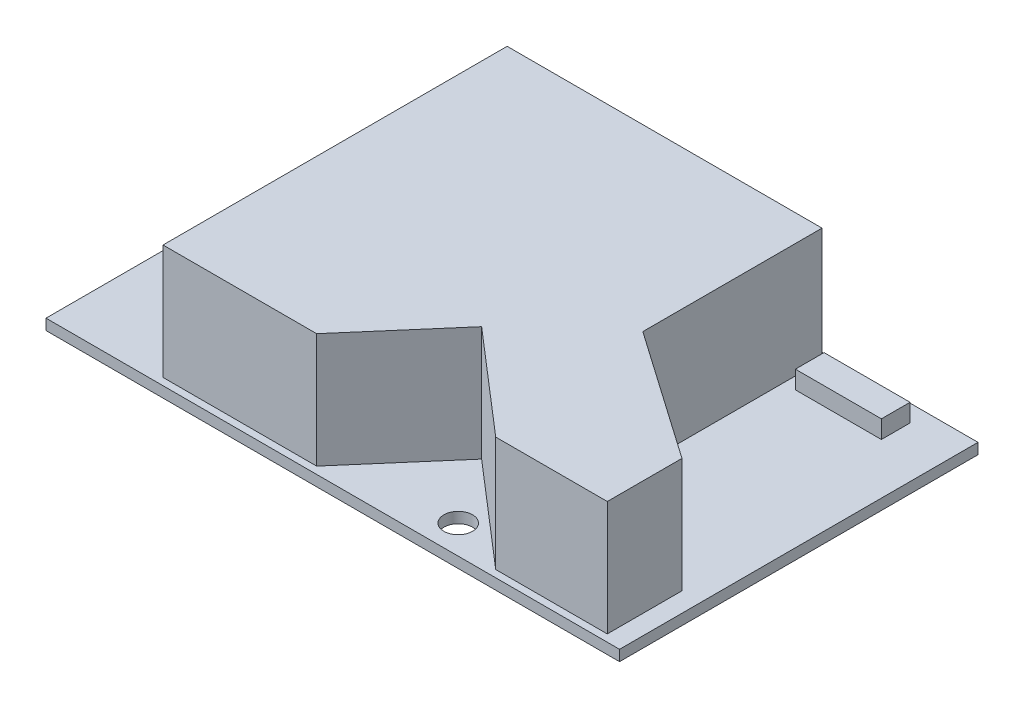
ISO-10303-21;
HEADER;
FILE_DESCRIPTION(('STEP AP214'),'2;1');
FILE_NAME('part.step','',(''),(''),'','','');
FILE_SCHEMA(('AUTOMOTIVE_DESIGN { 1 0 10303 214 1 1 1 1 }'));
ENDSEC;
DATA;
#1=APPLICATION_CONTEXT('core data for automotive mechanical design processes');
#2=APPLICATION_PROTOCOL_DEFINITION('international standard','automotive_design',2000,#1);
#3=PRODUCT_CONTEXT('',#1,'mechanical');
#4=PRODUCT('Part','Part','',(#3));
#5=PRODUCT_RELATED_PRODUCT_CATEGORY('part','',(#4));
#6=PRODUCT_DEFINITION_FORMATION('','',#4);
#7=PRODUCT_DEFINITION_CONTEXT('part definition',#1,'design');
#8=PRODUCT_DEFINITION('design','',#6,#7);
#9=PRODUCT_DEFINITION_SHAPE('','',#8);
#10=(LENGTH_UNIT() NAMED_UNIT(*) SI_UNIT(.MILLI.,.METRE.));
#11=(NAMED_UNIT(*) PLANE_ANGLE_UNIT() SI_UNIT($,.RADIAN.));
#12=(NAMED_UNIT(*) SI_UNIT($,.STERADIAN.) SOLID_ANGLE_UNIT());
#13=UNCERTAINTY_MEASURE_WITH_UNIT(LENGTH_MEASURE(1.E-05),#10,'distance_accuracy_value','');
#14=(GEOMETRIC_REPRESENTATION_CONTEXT(3) GLOBAL_UNCERTAINTY_ASSIGNED_CONTEXT((#13)) GLOBAL_UNIT_ASSIGNED_CONTEXT((#10,
#11,#12)) REPRESENTATION_CONTEXT('',''));
#15=CARTESIAN_POINT('',(0.,0.,0.));
#16=DIRECTION('',(0.,0.,1.));
#17=DIRECTION('',(1.,0.,0.));
#18=AXIS2_PLACEMENT_3D('',#15,#16,#17);
#19=CARTESIAN_POINT('',(0.,1.5,0.));
#20=DIRECTION('',(0.,-1.,0.));
#21=DIRECTION('',(0.,0.,-1.));
#22=AXIS2_PLACEMENT_3D('',#19,#20,#21);
#23=PLANE('',#22);
#24=DIRECTION('',(-1.,0.,0.));
#25=VECTOR('',#24,1.);
#26=CARTESIAN_POINT('',(0.,1.5,2.39777547862019));
#27=LINE('',#26,#25);
#28=CARTESIAN_POINT('',(72.9239174935539,1.5,2.39777547862019));
#29=VERTEX_POINT('',#28);
#30=CARTESIAN_POINT('',(60.9239174935539,1.5,2.39777547862019));
#31=VERTEX_POINT('',#30);
#32=EDGE_CURVE('E203',#29,#31,#27,.T.);
#33=ORIENTED_EDGE('',*,*,#32,.F.);
#34=DIRECTION('',(0.,0.,1.));
#35=VECTOR('',#34,1.);
#36=CARTESIAN_POINT('',(72.9239174935539,1.5,0.));
#37=LINE('',#36,#35);
#38=CARTESIAN_POINT('',(72.9239174935539,1.5,6.39777547862019));
#39=VERTEX_POINT('',#38);
#40=EDGE_CURVE('E205',#29,#39,#37,.T.);
#41=ORIENTED_EDGE('',*,*,#40,.T.);
#42=DIRECTION('',(-1.,0.,0.));
#43=VECTOR('',#42,1.);
#44=CARTESIAN_POINT('',(0.,1.5,6.39777547862018));
#45=LINE('',#44,#43);
#46=CARTESIAN_POINT('',(60.9239174935539,1.5,6.39777547862019));
#47=VERTEX_POINT('',#46);
#48=EDGE_CURVE('E174',#39,#47,#45,.T.);
#49=ORIENTED_EDGE('',*,*,#48,.T.);
#50=DIRECTION('',(0.,0.,1.));
#51=VECTOR('',#50,1.);
#52=CARTESIAN_POINT('',(60.9239174935539,1.5,0.));
#53=LINE('',#52,#51);
#54=EDGE_CURVE('E201',#31,#47,#53,.T.);
#55=ORIENTED_EDGE('',*,*,#54,.F.);
#56=EDGE_LOOP('',(#33,#41,#49,#55));
#57=FACE_BOUND('',#56,.T.);
#58=CARTESIAN_POINT('',(53.5,1.5,46.));
#59=DIRECTION('',(0.,1.,0.));
#60=DIRECTION('',(0.,0.,1.));
#61=AXIS2_PLACEMENT_3D('',#58,#59,#60);
#62=CIRCLE('',#61,2.);
#63=CARTESIAN_POINT('',(53.5,1.5,48.));
#64=VERTEX_POINT('',#63);
#65=EDGE_CURVE('E276',#64,#64,#62,.T.);
#66=ORIENTED_EDGE('',*,*,#65,.F.);
#67=EDGE_LOOP('',(#66));
#68=FACE_BOUND('',#67,.T.);
#69=DIRECTION('',(1.,0.,0.));
#70=VECTOR('',#69,1.);
#71=CARTESIAN_POINT('',(0.,1.5,50.));
#72=LINE('',#71,#70);
#73=CARTESIAN_POINT('',(0.,1.5,50.));
#74=VERTEX_POINT('',#73);
#75=CARTESIAN_POINT('',(80.,1.5,50.));
#76=VERTEX_POINT('',#75);
#77=EDGE_CURVE('E282',#74,#76,#72,.T.);
#78=ORIENTED_EDGE('',*,*,#77,.T.);
#79=DIRECTION('',(0.,0.,1.));
#80=VECTOR('',#79,1.);
#81=CARTESIAN_POINT('',(80.,1.5,0.));
#82=LINE('',#81,#80);
#83=CARTESIAN_POINT('',(80.,1.5,0.));
#84=VERTEX_POINT('',#83);
#85=EDGE_CURVE('E284',#84,#76,#82,.T.);
#86=ORIENTED_EDGE('',*,*,#85,.F.);
#87=DIRECTION('',(1.,0.,0.));
#88=VECTOR('',#87,1.);
#89=CARTESIAN_POINT('',(0.,1.5,0.));
#90=LINE('',#89,#88);
#91=CARTESIAN_POINT('',(0.,1.5,0.));
#92=VERTEX_POINT('',#91);
#93=EDGE_CURVE('E288',#92,#84,#90,.T.);
#94=ORIENTED_EDGE('',*,*,#93,.F.);
#95=DIRECTION('',(0.,0.,1.));
#96=VECTOR('',#95,1.);
#97=CARTESIAN_POINT('',(0.,1.5,0.));
#98=LINE('',#97,#96);
#99=EDGE_CURVE('E291',#92,#74,#98,.T.);
#100=ORIENTED_EDGE('',*,*,#99,.T.);
#101=EDGE_LOOP('',(#78,#86,#94,#100));
#102=FACE_BOUND('',#101,.T.);
#103=DIRECTION('',(-0.820282278426434,0.,-0.571958900358705));
#104=VECTOR('',#103,1.);
#105=CARTESIAN_POINT('',(7.18336419665643,1.5,-10.302114970682));
#106=LINE('',#105,#104);
#107=CARTESIAN_POINT('',(77.2927235468757,1.5,38.5830958078915));
#108=VERTEX_POINT('',#107);
#109=CARTESIAN_POINT('',(59.2465134214941,1.5,26.));
#110=VERTEX_POINT('',#109);
#111=EDGE_CURVE('E273',#108,#110,#106,.T.);
#112=ORIENTED_EDGE('',*,*,#111,.F.);
#113=DIRECTION('',(0.,0.,1.));
#114=VECTOR('',#113,1.);
#115=CARTESIAN_POINT('',(77.2927235468757,1.5,0.));
#116=LINE('',#115,#114);
#117=CARTESIAN_POINT('',(77.2927235468757,1.5,49.));
#118=VERTEX_POINT('',#117);
#119=EDGE_CURVE('E253',#108,#118,#116,.T.);
#120=ORIENTED_EDGE('',*,*,#119,.T.);
#121=DIRECTION('',(1.,0.,0.));
#122=VECTOR('',#121,1.);
#123=CARTESIAN_POINT('',(0.,1.5,49.));
#124=LINE('',#123,#122);
#125=CARTESIAN_POINT('',(61.7292549895042,1.5,49.));
#126=VERTEX_POINT('',#125);
#127=EDGE_CURVE('E256',#126,#118,#124,.T.);
#128=ORIENTED_EDGE('',*,*,#127,.F.);
#129=DIRECTION('',(-0.757218069936498,0.,-0.653162150282489));
#130=VECTOR('',#129,1.);
#131=CARTESIAN_POINT('',(2.10026085448915,1.5,-2.43485552540305));
#132=LINE('',#131,#130);
#133=CARTESIAN_POINT('',(47.407334239186,1.5,36.6461789214332));
#134=VERTEX_POINT('',#133);
#135=EDGE_CURVE('E258',#126,#134,#132,.T.);
#136=ORIENTED_EDGE('',*,*,#135,.T.);
#137=DIRECTION('',(-0.653162150282489,0.,0.757218069936498));
#138=VECTOR('',#137,1.);
#139=CARTESIAN_POINT('',(45.3070733846969,1.5,39.0810344468362));
#140=LINE('',#139,#138);
#141=CARTESIAN_POINT('',(36.7511591421515,1.5,49.));
#142=VERTEX_POINT('',#141);
#143=EDGE_CURVE('E261',#134,#142,#140,.T.);
#144=ORIENTED_EDGE('',*,*,#143,.T.);
#145=DIRECTION('',(1.,0.,0.));
#146=VECTOR('',#145,1.);
#147=CARTESIAN_POINT('',(0.,1.5,49.));
#148=LINE('',#147,#146);
#149=CARTESIAN_POINT('',(15.3220982650606,1.5,49.));
#150=VERTEX_POINT('',#149);
#151=EDGE_CURVE('E264',#150,#142,#148,.T.);
#152=ORIENTED_EDGE('',*,*,#151,.F.);
#153=DIRECTION('',(0.,0.,1.));
#154=VECTOR('',#153,1.);
#155=CARTESIAN_POINT('',(15.3220982650606,1.5,0.));
#156=LINE('',#155,#154);
#157=CARTESIAN_POINT('',(15.3220982650606,1.5,1.));
#158=VERTEX_POINT('',#157);
#159=EDGE_CURVE('E266',#158,#150,#156,.T.);
#160=ORIENTED_EDGE('',*,*,#159,.F.);
#161=DIRECTION('',(1.,0.,0.));
#162=VECTOR('',#161,1.);
#163=CARTESIAN_POINT('',(0.,1.5,1.));
#164=LINE('',#163,#162);
#165=CARTESIAN_POINT('',(59.2465134214941,1.5,1.));
#166=VERTEX_POINT('',#165);
#167=EDGE_CURVE('E268',#158,#166,#164,.T.);
#168=ORIENTED_EDGE('',*,*,#167,.T.);
#169=DIRECTION('',(0.,0.,-1.));
#170=VECTOR('',#169,1.);
#171=CARTESIAN_POINT('',(59.2465134214941,1.5,0.));
#172=LINE('',#171,#170);
#173=EDGE_CURVE('E271',#110,#166,#172,.T.);
#174=ORIENTED_EDGE('',*,*,#173,.F.);
#175=EDGE_LOOP('',(#112,#120,#128,#136,#144,#152,#160,#168,#174));
#176=FACE_BOUND('',#175,.T.);
#177=ADVANCED_FACE('F51',(#57,#68,#102,#176),#23,.F.);
#178=CARTESIAN_POINT('',(0.,0.,0.));
#179=DIRECTION('',(0.,-1.,0.));
#180=DIRECTION('',(0.,0.,-1.));
#181=AXIS2_PLACEMENT_3D('',#178,#179,#180);
#182=PLANE('',#181);
#183=DIRECTION('',(1.,0.,0.));
#184=VECTOR('',#183,1.);
#185=CARTESIAN_POINT('',(0.,0.,50.));
#186=LINE('',#185,#184);
#187=CARTESIAN_POINT('',(0.,0.,50.));
#188=VERTEX_POINT('',#187);
#189=CARTESIAN_POINT('',(80.,0.,50.));
#190=VERTEX_POINT('',#189);
#191=EDGE_CURVE('E279',#188,#190,#186,.T.);
#192=ORIENTED_EDGE('',*,*,#191,.F.);
#193=DIRECTION('',(0.,0.,1.));
#194=VECTOR('',#193,1.);
#195=CARTESIAN_POINT('',(0.,0.,0.));
#196=LINE('',#195,#194);
#197=CARTESIAN_POINT('',(0.,0.,0.));
#198=VERTEX_POINT('',#197);
#199=EDGE_CURVE('E285',#198,#188,#196,.T.);
#200=ORIENTED_EDGE('',*,*,#199,.F.);
#201=DIRECTION('',(1.,0.,0.));
#202=VECTOR('',#201,1.);
#203=CARTESIAN_POINT('',(0.,0.,0.));
#204=LINE('',#203,#202);
#205=CARTESIAN_POINT('',(80.,0.,0.));
#206=VERTEX_POINT('',#205);
#207=EDGE_CURVE('E299',#198,#206,#204,.T.);
#208=ORIENTED_EDGE('',*,*,#207,.T.);
#209=DIRECTION('',(0.,0.,1.));
#210=VECTOR('',#209,1.);
#211=CARTESIAN_POINT('',(80.,0.,0.));
#212=LINE('',#211,#210);
#213=EDGE_CURVE('E296',#206,#190,#212,.T.);
#214=ORIENTED_EDGE('',*,*,#213,.T.);
#215=EDGE_LOOP('',(#192,#200,#208,#214));
#216=FACE_BOUND('',#215,.T.);
#217=CARTESIAN_POINT('',(53.5,0.,46.));
#218=DIRECTION('',(0.,1.,0.));
#219=DIRECTION('',(0.,0.,1.));
#220=AXIS2_PLACEMENT_3D('',#217,#218,#219);
#221=CIRCLE('',#220,2.);
#222=CARTESIAN_POINT('',(53.5,0.,48.));
#223=VERTEX_POINT('',#222);
#224=EDGE_CURVE('E275',#223,#223,#221,.T.);
#225=ORIENTED_EDGE('',*,*,#224,.T.);
#226=EDGE_LOOP('',(#225));
#227=FACE_BOUND('',#226,.T.);
#228=ADVANCED_FACE('F318',(#216,#227),#182,.T.);
#229=CARTESIAN_POINT('',(0.,1.5,50.));
#230=DIRECTION('',(0.,0.,-1.));
#231=DIRECTION('',(-1.,0.,0.));
#232=AXIS2_PLACEMENT_3D('',#229,#230,#231);
#233=PLANE('',#232);
#234=ORIENTED_EDGE('',*,*,#191,.T.);
#235=DIRECTION('',(0.,-1.,0.));
#236=VECTOR('',#235,1.);
#237=CARTESIAN_POINT('',(80.,1.5,50.));
#238=LINE('',#237,#236);
#239=EDGE_CURVE('E12',#76,#190,#238,.T.);
#240=ORIENTED_EDGE('',*,*,#239,.F.);
#241=ORIENTED_EDGE('',*,*,#77,.F.);
#242=DIRECTION('',(0.,-1.,0.));
#243=VECTOR('',#242,1.);
#244=CARTESIAN_POINT('',(0.,1.5,50.));
#245=LINE('',#244,#243);
#246=EDGE_CURVE('E293',#74,#188,#245,.T.);
#247=ORIENTED_EDGE('',*,*,#246,.T.);
#248=EDGE_LOOP('',(#234,#240,#241,#247));
#249=FACE_BOUND('',#248,.T.);
#250=ADVANCED_FACE('F53',(#249),#233,.F.);
#251=CARTESIAN_POINT('',(80.,1.5,0.));
#252=DIRECTION('',(1.,0.,0.));
#253=DIRECTION('',(0.,0.,-1.));
#254=AXIS2_PLACEMENT_3D('',#251,#252,#253);
#255=PLANE('',#254);
#256=ORIENTED_EDGE('',*,*,#213,.F.);
#257=DIRECTION('',(0.,-1.,0.));
#258=VECTOR('',#257,1.);
#259=CARTESIAN_POINT('',(80.,1.5,0.));
#260=LINE('',#259,#258);
#261=EDGE_CURVE('E59',#84,#206,#260,.T.);
#262=ORIENTED_EDGE('',*,*,#261,.F.);
#263=ORIENTED_EDGE('',*,*,#85,.T.);
#264=ORIENTED_EDGE('',*,*,#239,.T.);
#265=EDGE_LOOP('',(#256,#262,#263,#264));
#266=FACE_BOUND('',#265,.T.);
#267=ADVANCED_FACE('F313',(#266),#255,.T.);
#268=CARTESIAN_POINT('',(0.,1.5,0.));
#269=DIRECTION('',(0.,0.,-1.));
#270=DIRECTION('',(-1.,0.,0.));
#271=AXIS2_PLACEMENT_3D('',#268,#269,#270);
#272=PLANE('',#271);
#273=ORIENTED_EDGE('',*,*,#207,.F.);
#274=DIRECTION('',(0.,-1.,0.));
#275=VECTOR('',#274,1.);
#276=CARTESIAN_POINT('',(0.,1.5,0.));
#277=LINE('',#276,#275);
#278=EDGE_CURVE('E305',#92,#198,#277,.T.);
#279=ORIENTED_EDGE('',*,*,#278,.F.);
#280=ORIENTED_EDGE('',*,*,#93,.T.);
#281=ORIENTED_EDGE('',*,*,#261,.T.);
#282=EDGE_LOOP('',(#273,#279,#280,#281));
#283=FACE_BOUND('',#282,.T.);
#284=ADVANCED_FACE('F309',(#283),#272,.T.);
#285=CARTESIAN_POINT('',(0.,1.5,0.));
#286=DIRECTION('',(1.,0.,0.));
#287=DIRECTION('',(0.,0.,-1.));
#288=AXIS2_PLACEMENT_3D('',#285,#286,#287);
#289=PLANE('',#288);
#290=ORIENTED_EDGE('',*,*,#199,.T.);
#291=ORIENTED_EDGE('',*,*,#246,.F.);
#292=ORIENTED_EDGE('',*,*,#99,.F.);
#293=ORIENTED_EDGE('',*,*,#278,.T.);
#294=EDGE_LOOP('',(#290,#291,#292,#293));
#295=FACE_BOUND('',#294,.T.);
#296=ADVANCED_FACE('F322',(#295),#289,.F.);
#297=CARTESIAN_POINT('',(53.5,1.5,46.));
#298=DIRECTION('',(0.,-1.,0.));
#299=DIRECTION('',(0.,0.,-1.));
#300=AXIS2_PLACEMENT_3D('',#297,#298,#299);
#301=CYLINDRICAL_SURFACE('',#300,2.);
#302=ORIENTED_EDGE('',*,*,#65,.T.);
#303=EDGE_LOOP('',(#302));
#304=FACE_BOUND('',#303,.T.);
#305=ORIENTED_EDGE('',*,*,#224,.F.);
#306=EDGE_LOOP('',(#305));
#307=FACE_BOUND('',#306,.T.);
#308=ADVANCED_FACE('F383',(#304,#307),#301,.F.);
#309=CARTESIAN_POINT('',(7.18336419665643,17.5,-10.302114970682));
#310=DIRECTION('',(-0.571958900358705,0.,0.820282278426434));
#311=DIRECTION('',(0.820282278426434,0.,0.571958900358705));
#312=AXIS2_PLACEMENT_3D('',#309,#310,#311);
#313=PLANE('',#312);
#314=DIRECTION('',(0.,-1.,0.));
#315=VECTOR('',#314,1.);
#316=CARTESIAN_POINT('',(77.2927235468757,17.5,38.5830958078915));
#317=LINE('',#316,#315);
#318=CARTESIAN_POINT('',(77.2927235468757,17.5,38.5830958078915));
#319=VERTEX_POINT('',#318);
#320=EDGE_CURVE('E228',#319,#108,#317,.T.);
#321=ORIENTED_EDGE('',*,*,#320,.T.);
#322=ORIENTED_EDGE('',*,*,#111,.T.);
#323=DIRECTION('',(0.,-1.,0.));
#324=VECTOR('',#323,1.);
#325=CARTESIAN_POINT('',(59.2465134214941,17.5,26.));
#326=LINE('',#325,#324);
#327=CARTESIAN_POINT('',(59.2465134214941,17.5,26.));
#328=VERTEX_POINT('',#327);
#329=EDGE_CURVE('E250',#328,#110,#326,.T.);
#330=ORIENTED_EDGE('',*,*,#329,.F.);
#331=DIRECTION('',(-0.820282278426434,0.,-0.571958900358705));
#332=VECTOR('',#331,1.);
#333=CARTESIAN_POINT('',(7.18336419665643,17.5,-10.302114970682));
#334=LINE('',#333,#332);
#335=EDGE_CURVE('E207',#319,#328,#334,.T.);
#336=ORIENTED_EDGE('',*,*,#335,.F.);
#337=EDGE_LOOP('',(#321,#322,#330,#336));
#338=FACE_BOUND('',#337,.T.);
#339=ADVANCED_FACE('F336',(#338),#313,.F.);
#340=CARTESIAN_POINT('',(59.2465134214941,17.5,0.));
#341=DIRECTION('',(-1.,0.,0.));
#342=DIRECTION('',(0.,0.,1.));
#343=AXIS2_PLACEMENT_3D('',#340,#341,#342);
#344=PLANE('',#343);
#345=ORIENTED_EDGE('',*,*,#329,.T.);
#346=ORIENTED_EDGE('',*,*,#173,.T.);
#347=DIRECTION('',(0.,-1.,0.));
#348=VECTOR('',#347,1.);
#349=CARTESIAN_POINT('',(59.2465134214941,17.5,1.));
#350=LINE('',#349,#348);
#351=CARTESIAN_POINT('',(59.2465134214941,17.5,1.));
#352=VERTEX_POINT('',#351);
#353=EDGE_CURVE('E247',#352,#166,#350,.T.);
#354=ORIENTED_EDGE('',*,*,#353,.F.);
#355=DIRECTION('',(0.,0.,-1.));
#356=VECTOR('',#355,1.);
#357=CARTESIAN_POINT('',(59.2465134214941,17.5,0.));
#358=LINE('',#357,#356);
#359=EDGE_CURVE('E210',#328,#352,#358,.T.);
#360=ORIENTED_EDGE('',*,*,#359,.F.);
#361=EDGE_LOOP('',(#345,#346,#354,#360));
#362=FACE_BOUND('',#361,.T.);
#363=ADVANCED_FACE('F339',(#362),#344,.F.);
#364=CARTESIAN_POINT('',(0.,17.5,1.));
#365=DIRECTION('',(0.,0.,-1.));
#366=DIRECTION('',(-1.,0.,0.));
#367=AXIS2_PLACEMENT_3D('',#364,#365,#366);
#368=PLANE('',#367);
#369=ORIENTED_EDGE('',*,*,#167,.F.);
#370=DIRECTION('',(0.,-1.,0.));
#371=VECTOR('',#370,1.);
#372=CARTESIAN_POINT('',(15.3220982650606,17.5,1.));
#373=LINE('',#372,#371);
#374=CARTESIAN_POINT('',(15.3220982650606,17.5,1.));
#375=VERTEX_POINT('',#374);
#376=EDGE_CURVE('E244',#375,#158,#373,.T.);
#377=ORIENTED_EDGE('',*,*,#376,.F.);
#378=DIRECTION('',(1.,0.,0.));
#379=VECTOR('',#378,1.);
#380=CARTESIAN_POINT('',(0.,17.5,1.));
#381=LINE('',#380,#379);
#382=EDGE_CURVE('E212',#375,#352,#381,.T.);
#383=ORIENTED_EDGE('',*,*,#382,.T.);
#384=ORIENTED_EDGE('',*,*,#353,.T.);
#385=EDGE_LOOP('',(#369,#377,#383,#384));
#386=FACE_BOUND('',#385,.T.);
#387=ADVANCED_FACE('F374',(#386),#368,.T.);
#388=CARTESIAN_POINT('',(15.3220982650606,17.5,0.));
#389=DIRECTION('',(1.,0.,0.));
#390=DIRECTION('',(0.,0.,-1.));
#391=AXIS2_PLACEMENT_3D('',#388,#389,#390);
#392=PLANE('',#391);
#393=ORIENTED_EDGE('',*,*,#376,.T.);
#394=ORIENTED_EDGE('',*,*,#159,.T.);
#395=DIRECTION('',(0.,-1.,0.));
#396=VECTOR('',#395,1.);
#397=CARTESIAN_POINT('',(15.3220982650606,17.5,49.));
#398=LINE('',#397,#396);
#399=CARTESIAN_POINT('',(15.3220982650606,17.5,49.));
#400=VERTEX_POINT('',#399);
#401=EDGE_CURVE('E241',#400,#150,#398,.T.);
#402=ORIENTED_EDGE('',*,*,#401,.F.);
#403=DIRECTION('',(0.,0.,1.));
#404=VECTOR('',#403,1.);
#405=CARTESIAN_POINT('',(15.3220982650606,17.5,0.));
#406=LINE('',#405,#404);
#407=EDGE_CURVE('E215',#375,#400,#406,.T.);
#408=ORIENTED_EDGE('',*,*,#407,.F.);
#409=EDGE_LOOP('',(#393,#394,#402,#408));
#410=FACE_BOUND('',#409,.T.);
#411=ADVANCED_FACE('F364',(#410),#392,.F.);
#412=CARTESIAN_POINT('',(0.,17.5,49.));
#413=DIRECTION('',(0.,0.,-1.));
#414=DIRECTION('',(-1.,0.,0.));
#415=AXIS2_PLACEMENT_3D('',#412,#413,#414);
#416=PLANE('',#415);
#417=ORIENTED_EDGE('',*,*,#401,.T.);
#418=ORIENTED_EDGE('',*,*,#151,.T.);
#419=DIRECTION('',(0.,-1.,0.));
#420=VECTOR('',#419,1.);
#421=CARTESIAN_POINT('',(36.7511591421515,17.5,49.));
#422=LINE('',#421,#420);
#423=CARTESIAN_POINT('',(36.7511591421515,17.5,49.));
#424=VERTEX_POINT('',#423);
#425=EDGE_CURVE('E238',#424,#142,#422,.T.);
#426=ORIENTED_EDGE('',*,*,#425,.F.);
#427=DIRECTION('',(1.,0.,0.));
#428=VECTOR('',#427,1.);
#429=CARTESIAN_POINT('',(0.,17.5,49.));
#430=LINE('',#429,#428);
#431=EDGE_CURVE('E217',#400,#424,#430,.T.);
#432=ORIENTED_EDGE('',*,*,#431,.F.);
#433=EDGE_LOOP('',(#417,#418,#426,#432));
#434=FACE_BOUND('',#433,.T.);
#435=ADVANCED_FACE('F359',(#434),#416,.F.);
#436=CARTESIAN_POINT('',(45.3070733846969,17.5,39.0810344468362));
#437=DIRECTION('',(0.757218069936498,0.,0.653162150282489));
#438=DIRECTION('',(0.653162150282489,0.,-0.757218069936498));
#439=AXIS2_PLACEMENT_3D('',#436,#437,#438);
#440=PLANE('',#439);
#441=ORIENTED_EDGE('',*,*,#143,.F.);
#442=DIRECTION('',(0.,-1.,0.));
#443=VECTOR('',#442,1.);
#444=CARTESIAN_POINT('',(47.407334239186,17.5,36.6461789214332));
#445=LINE('',#444,#443);
#446=CARTESIAN_POINT('',(47.407334239186,17.5,36.6461789214332));
#447=VERTEX_POINT('',#446);
#448=EDGE_CURVE('E235',#447,#134,#445,.T.);
#449=ORIENTED_EDGE('',*,*,#448,.F.);
#450=DIRECTION('',(-0.653162150282489,0.,0.757218069936498));
#451=VECTOR('',#450,1.);
#452=CARTESIAN_POINT('',(45.3070733846969,17.5,39.0810344468362));
#453=LINE('',#452,#451);
#454=EDGE_CURVE('E219',#447,#424,#453,.T.);
#455=ORIENTED_EDGE('',*,*,#454,.T.);
#456=ORIENTED_EDGE('',*,*,#425,.T.);
#457=EDGE_LOOP('',(#441,#449,#455,#456));
#458=FACE_BOUND('',#457,.T.);
#459=ADVANCED_FACE('F363',(#458),#440,.T.);
#460=CARTESIAN_POINT('',(2.10026085448915,17.5,-2.43485552540305));
#461=DIRECTION('',(-0.653162150282489,0.,0.757218069936498));
#462=DIRECTION('',(0.757218069936498,0.,0.653162150282489));
#463=AXIS2_PLACEMENT_3D('',#460,#461,#462);
#464=PLANE('',#463);
#465=ORIENTED_EDGE('',*,*,#135,.F.);
#466=DIRECTION('',(0.,-1.,0.));
#467=VECTOR('',#466,1.);
#468=CARTESIAN_POINT('',(61.7292549895042,17.5,49.));
#469=LINE('',#468,#467);
#470=CARTESIAN_POINT('',(61.7292549895042,17.5,49.));
#471=VERTEX_POINT('',#470);
#472=EDGE_CURVE('E232',#471,#126,#469,.T.);
#473=ORIENTED_EDGE('',*,*,#472,.F.);
#474=DIRECTION('',(-0.757218069936498,0.,-0.653162150282489));
#475=VECTOR('',#474,1.);
#476=CARTESIAN_POINT('',(2.10026085448915,17.5,-2.43485552540305));
#477=LINE('',#476,#475);
#478=EDGE_CURVE('E223',#471,#447,#477,.T.);
#479=ORIENTED_EDGE('',*,*,#478,.T.);
#480=ORIENTED_EDGE('',*,*,#448,.T.);
#481=EDGE_LOOP('',(#465,#473,#479,#480));
#482=FACE_BOUND('',#481,.T.);
#483=ADVANCED_FACE('F356',(#482),#464,.T.);
#484=ORIENTED_EDGE('',*,*,#472,.T.);
#485=ORIENTED_EDGE('',*,*,#127,.T.);
#486=DIRECTION('',(0.,-1.,0.));
#487=VECTOR('',#486,1.);
#488=CARTESIAN_POINT('',(77.2927235468757,17.5,49.));
#489=LINE('',#488,#487);
#490=CARTESIAN_POINT('',(77.2927235468757,17.5,49.));
#491=VERTEX_POINT('',#490);
#492=EDGE_CURVE('E74',#491,#118,#489,.T.);
#493=ORIENTED_EDGE('',*,*,#492,.F.);
#494=EDGE_CURVE('E220',#471,#491,#430,.T.);
#495=ORIENTED_EDGE('',*,*,#494,.F.);
#496=EDGE_LOOP('',(#484,#485,#493,#495));
#497=FACE_BOUND('',#496,.T.);
#498=ADVANCED_FACE('F349',(#497),#416,.F.);
#499=CARTESIAN_POINT('',(77.2927235468757,17.5,0.));
#500=DIRECTION('',(1.,0.,0.));
#501=DIRECTION('',(0.,0.,-1.));
#502=AXIS2_PLACEMENT_3D('',#499,#500,#501);
#503=PLANE('',#502);
#504=ORIENTED_EDGE('',*,*,#119,.F.);
#505=ORIENTED_EDGE('',*,*,#320,.F.);
#506=DIRECTION('',(0.,0.,1.));
#507=VECTOR('',#506,1.);
#508=CARTESIAN_POINT('',(77.2927235468757,17.5,0.));
#509=LINE('',#508,#507);
#510=EDGE_CURVE('E226',#319,#491,#509,.T.);
#511=ORIENTED_EDGE('',*,*,#510,.T.);
#512=ORIENTED_EDGE('',*,*,#492,.T.);
#513=EDGE_LOOP('',(#504,#505,#511,#512));
#514=FACE_BOUND('',#513,.T.);
#515=ADVANCED_FACE('F347',(#514),#503,.T.);
#516=CARTESIAN_POINT('',(0.,17.5,0.));
#517=DIRECTION('',(0.,1.,0.));
#518=DIRECTION('',(0.,0.,1.));
#519=AXIS2_PLACEMENT_3D('',#516,#517,#518);
#520=PLANE('',#519);
#521=ORIENTED_EDGE('',*,*,#335,.T.);
#522=ORIENTED_EDGE('',*,*,#359,.T.);
#523=ORIENTED_EDGE('',*,*,#382,.F.);
#524=ORIENTED_EDGE('',*,*,#407,.T.);
#525=ORIENTED_EDGE('',*,*,#431,.T.);
#526=ORIENTED_EDGE('',*,*,#454,.F.);
#527=ORIENTED_EDGE('',*,*,#478,.F.);
#528=ORIENTED_EDGE('',*,*,#494,.T.);
#529=ORIENTED_EDGE('',*,*,#510,.F.);
#530=EDGE_LOOP('',(#521,#522,#523,#524,#525,#526,#527,#528,#529));
#531=FACE_BOUND('',#530,.T.);
#532=ADVANCED_FACE('F344',(#531),#520,.T.);
#533=CARTESIAN_POINT('',(72.9239174935539,4.,2.39777547862019));
#534=DIRECTION('',(1.,0.,0.));
#535=DIRECTION('',(0.,0.,-1.));
#536=AXIS2_PLACEMENT_3D('',#533,#534,#535);
#537=PLANE('',#536);
#538=ORIENTED_EDGE('',*,*,#40,.F.);
#539=DIRECTION('',(0.,-1.,0.));
#540=VECTOR('',#539,1.);
#541=CARTESIAN_POINT('',(72.9239174935539,4.,2.39777547862019));
#542=LINE('',#541,#540);
#543=CARTESIAN_POINT('',(72.9239174935539,4.,2.39777547862019));
#544=VERTEX_POINT('',#543);
#545=EDGE_CURVE('E189',#544,#29,#542,.T.);
#546=ORIENTED_EDGE('',*,*,#545,.F.);
#547=DIRECTION('',(0.,0.,1.));
#548=VECTOR('',#547,1.);
#549=CARTESIAN_POINT('',(72.9239174935539,4.,2.39777547862019));
#550=LINE('',#549,#548);
#551=CARTESIAN_POINT('',(72.9239174935539,4.,6.39777547862019));
#552=VERTEX_POINT('',#551);
#553=EDGE_CURVE('E183',#544,#552,#550,.T.);
#554=ORIENTED_EDGE('',*,*,#553,.T.);
#555=DIRECTION('',(0.,-1.,0.));
#556=VECTOR('',#555,1.);
#557=CARTESIAN_POINT('',(72.9239174935539,4.,6.39777547862019));
#558=LINE('',#557,#556);
#559=EDGE_CURVE('E169',#552,#39,#558,.T.);
#560=ORIENTED_EDGE('',*,*,#559,.T.);
#561=EDGE_LOOP('',(#538,#546,#554,#560));
#562=FACE_BOUND('',#561,.T.);
#563=ADVANCED_FACE('F187',(#562),#537,.T.);
#564=CARTESIAN_POINT('',(72.9239174935539,4.,2.39777547862019));
#565=DIRECTION('',(0.,0.,1.));
#566=DIRECTION('',(1.,0.,0.));
#567=AXIS2_PLACEMENT_3D('',#564,#565,#566);
#568=PLANE('',#567);
#569=ORIENTED_EDGE('',*,*,#545,.T.);
#570=ORIENTED_EDGE('',*,*,#32,.T.);
#571=DIRECTION('',(0.,-1.,0.));
#572=VECTOR('',#571,1.);
#573=CARTESIAN_POINT('',(60.9239174935539,4.,2.39777547862019));
#574=LINE('',#573,#572);
#575=CARTESIAN_POINT('',(60.9239174935539,4.,2.39777547862019));
#576=VERTEX_POINT('',#575);
#577=EDGE_CURVE('E196',#576,#31,#574,.T.);
#578=ORIENTED_EDGE('',*,*,#577,.F.);
#579=DIRECTION('',(-1.,0.,0.));
#580=VECTOR('',#579,1.);
#581=CARTESIAN_POINT('',(72.9239174935539,4.,2.39777547862019));
#582=LINE('',#581,#580);
#583=EDGE_CURVE('E178',#544,#576,#582,.T.);
#584=ORIENTED_EDGE('',*,*,#583,.F.);
#585=EDGE_LOOP('',(#569,#570,#578,#584));
#586=FACE_BOUND('',#585,.T.);
#587=ADVANCED_FACE('F486',(#586),#568,.F.);
#588=CARTESIAN_POINT('',(60.9239174935539,4.,2.39777547862019));
#589=DIRECTION('',(1.,0.,0.));
#590=DIRECTION('',(0.,0.,-1.));
#591=AXIS2_PLACEMENT_3D('',#588,#589,#590);
#592=PLANE('',#591);
#593=ORIENTED_EDGE('',*,*,#577,.T.);
#594=ORIENTED_EDGE('',*,*,#54,.T.);
#595=DIRECTION('',(0.,-1.,0.));
#596=VECTOR('',#595,1.);
#597=CARTESIAN_POINT('',(60.9239174935539,4.,6.39777547862019));
#598=LINE('',#597,#596);
#599=CARTESIAN_POINT('',(60.9239174935539,4.,6.39777547862019));
#600=VERTEX_POINT('',#599);
#601=EDGE_CURVE('E66',#600,#47,#598,.T.);
#602=ORIENTED_EDGE('',*,*,#601,.F.);
#603=DIRECTION('',(0.,0.,1.));
#604=VECTOR('',#603,1.);
#605=CARTESIAN_POINT('',(60.9239174935539,4.,2.39777547862019));
#606=LINE('',#605,#604);
#607=EDGE_CURVE('E185',#576,#600,#606,.T.);
#608=ORIENTED_EDGE('',*,*,#607,.F.);
#609=EDGE_LOOP('',(#593,#594,#602,#608));
#610=FACE_BOUND('',#609,.T.);
#611=ADVANCED_FACE('F492',(#610),#592,.F.);
#612=CARTESIAN_POINT('',(72.9239174935539,4.,6.39777547862019));
#613=DIRECTION('',(0.,0.,1.));
#614=DIRECTION('',(1.,0.,0.));
#615=AXIS2_PLACEMENT_3D('',#612,#613,#614);
#616=PLANE('',#615);
#617=ORIENTED_EDGE('',*,*,#48,.F.);
#618=ORIENTED_EDGE('',*,*,#559,.F.);
#619=DIRECTION('',(-1.,0.,0.));
#620=VECTOR('',#619,1.);
#621=CARTESIAN_POINT('',(72.9239174935539,4.,6.39777547862019));
#622=LINE('',#621,#620);
#623=EDGE_CURVE('E172',#552,#600,#622,.T.);
#624=ORIENTED_EDGE('',*,*,#623,.T.);
#625=ORIENTED_EDGE('',*,*,#601,.T.);
#626=EDGE_LOOP('',(#617,#618,#624,#625));
#627=FACE_BOUND('',#626,.T.);
#628=ADVANCED_FACE('F171',(#627),#616,.T.);
#629=CARTESIAN_POINT('',(0.,4.,0.));
#630=DIRECTION('',(0.,-1.,0.));
#631=DIRECTION('',(0.,0.,-1.));
#632=AXIS2_PLACEMENT_3D('',#629,#630,#631);
#633=PLANE('',#632);
#634=ORIENTED_EDGE('',*,*,#553,.F.);
#635=ORIENTED_EDGE('',*,*,#583,.T.);
#636=ORIENTED_EDGE('',*,*,#607,.T.);
#637=ORIENTED_EDGE('',*,*,#623,.F.);
#638=EDGE_LOOP('',(#634,#635,#636,#637));
#639=FACE_BOUND('',#638,.T.);
#640=ADVANCED_FACE('F182',(#639),#633,.F.);
#641=CLOSED_SHELL('',(#177,#228,#250,#267,#284,#296,#308,#339,#363,#387,#411,#435,#459,#483,
#498,#515,#532,#563,#587,#611,#628,#640));
#642=MANIFOLD_SOLID_BREP('B2',#641);
#643=ADVANCED_BREP_SHAPE_REPRESENTATION('',(#18,#642),#14);
#644=SHAPE_DEFINITION_REPRESENTATION(#9,#643);
ENDSEC;
END-ISO-10303-21;
